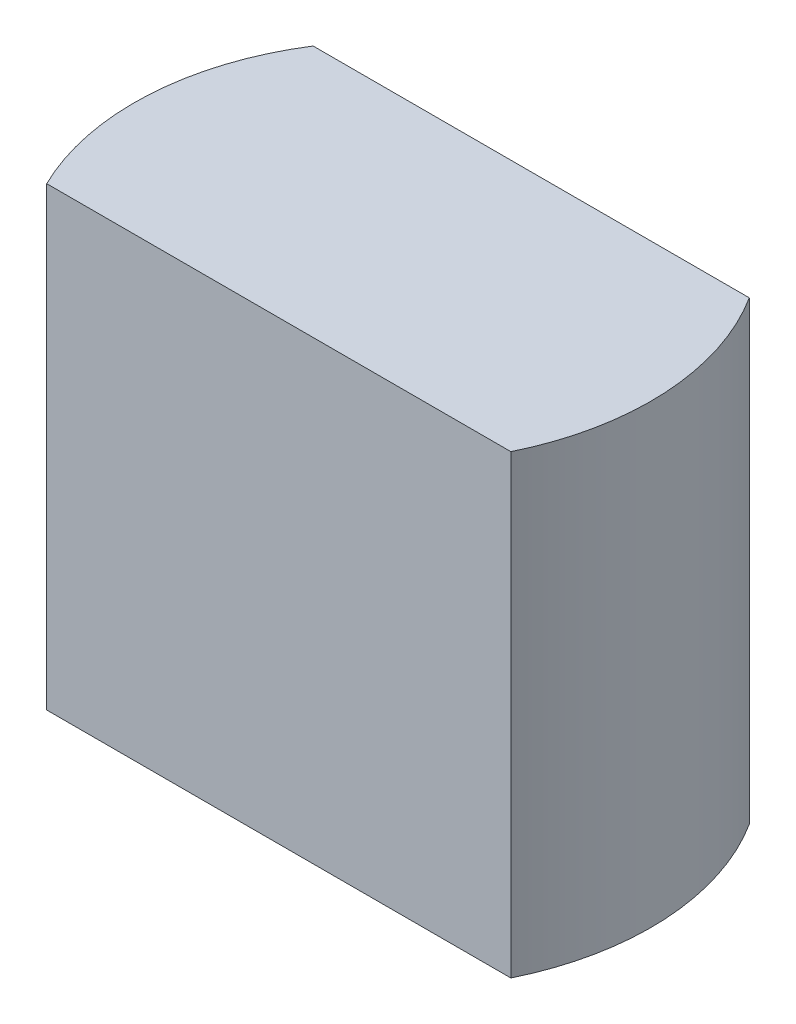
ISO-10303-21;
HEADER;
FILE_DESCRIPTION(('STEP AP214'),'2;1');
FILE_NAME('part.step','',(''),(''),'','','');
FILE_SCHEMA(('AUTOMOTIVE_DESIGN { 1 0 10303 214 1 1 1 1 }'));
ENDSEC;
DATA;
#1=APPLICATION_CONTEXT('core data for automotive mechanical design processes');
#2=APPLICATION_PROTOCOL_DEFINITION('international standard','automotive_design',2000,#1);
#3=PRODUCT_CONTEXT('',#1,'mechanical');
#4=PRODUCT('Part','Part','',(#3));
#5=PRODUCT_RELATED_PRODUCT_CATEGORY('part','',(#4));
#6=PRODUCT_DEFINITION_FORMATION('','',#4);
#7=PRODUCT_DEFINITION_CONTEXT('part definition',#1,'design');
#8=PRODUCT_DEFINITION('design','',#6,#7);
#9=PRODUCT_DEFINITION_SHAPE('','',#8);
#10=(LENGTH_UNIT() NAMED_UNIT(*) SI_UNIT(.MILLI.,.METRE.));
#11=(NAMED_UNIT(*) PLANE_ANGLE_UNIT() SI_UNIT($,.RADIAN.));
#12=(NAMED_UNIT(*) SI_UNIT($,.STERADIAN.) SOLID_ANGLE_UNIT());
#13=UNCERTAINTY_MEASURE_WITH_UNIT(LENGTH_MEASURE(1.E-05),#10,'distance_accuracy_value','');
#14=(GEOMETRIC_REPRESENTATION_CONTEXT(3) GLOBAL_UNCERTAINTY_ASSIGNED_CONTEXT((#13)) GLOBAL_UNIT_ASSIGNED_CONTEXT((#10,
#11,#12)) REPRESENTATION_CONTEXT('',''));
#15=CARTESIAN_POINT('',(0.,0.,0.));
#16=DIRECTION('',(0.,0.,1.));
#17=DIRECTION('',(1.,0.,0.));
#18=AXIS2_PLACEMENT_3D('',#15,#16,#17);
#19=CARTESIAN_POINT('',(0.,7.9371,0.));
#20=DIRECTION('',(0.,-1.,0.));
#21=DIRECTION('',(0.,0.,-1.));
#22=AXIS2_PLACEMENT_3D('',#19,#20,#21);
#23=CYLINDRICAL_SURFACE('',#22,4.5);
#24=CARTESIAN_POINT('',(0.,7.9371,0.));
#25=DIRECTION('',(0.,1.,0.));
#26=DIRECTION('',(0.,0.,1.));
#27=AXIS2_PLACEMENT_3D('',#24,#25,#26);
#28=CIRCLE('',#27,4.5);
#29=CARTESIAN_POINT('',(4.04079297537839,7.9371,1.98040201225223));
#30=VERTEX_POINT('',#29);
#31=CARTESIAN_POINT('',(3.79709635436919,7.9371,-2.41496568829378));
#32=VERTEX_POINT('',#31);
#33=EDGE_CURVE('E79',#30,#32,#28,.T.);
#34=ORIENTED_EDGE('',*,*,#33,.F.);
#35=DIRECTION('',(0.,-1.,0.));
#36=VECTOR('',#35,1.);
#37=CARTESIAN_POINT('',(4.04079297537839,7.9371,1.98040201225223));
#38=LINE('',#37,#36);
#39=CARTESIAN_POINT('',(4.04079297537839,0.,1.98040201225223));
#40=VERTEX_POINT('',#39);
#41=EDGE_CURVE('E73',#30,#40,#38,.T.);
#42=ORIENTED_EDGE('',*,*,#41,.T.);
#43=CARTESIAN_POINT('',(0.,0.,0.));
#44=DIRECTION('',(0.,1.,0.));
#45=DIRECTION('',(0.,0.,1.));
#46=AXIS2_PLACEMENT_3D('',#43,#44,#45);
#47=CIRCLE('',#46,4.5);
#48=CARTESIAN_POINT('',(3.79709635436919,0.,-2.41496568829378));
#49=VERTEX_POINT('',#48);
#50=EDGE_CURVE('E55',#40,#49,#47,.T.);
#51=ORIENTED_EDGE('',*,*,#50,.T.);
#52=DIRECTION('',(0.,-1.,0.));
#53=VECTOR('',#52,1.);
#54=CARTESIAN_POINT('',(3.79709635436919,7.9371,-2.41496568829378));
#55=LINE('',#54,#53);
#56=EDGE_CURVE('E88',#49,#32,#55,.F.);
#57=ORIENTED_EDGE('',*,*,#56,.T.);
#58=EDGE_LOOP('',(#34,#42,#51,#57));
#59=FACE_BOUND('',#58,.T.);
#60=ADVANCED_FACE('F33',(#59),#23,.T.);
#61=CARTESIAN_POINT('',(-3.79709635436919,0.,-2.41496568829378));
#62=VERTEX_POINT('',#61);
#63=CARTESIAN_POINT('',(-4.04079297537839,0.,1.98040201225223));
#64=VERTEX_POINT('',#63);
#65=EDGE_CURVE('E84',#62,#64,#47,.T.);
#66=ORIENTED_EDGE('',*,*,#65,.T.);
#67=DIRECTION('',(0.,-1.,0.));
#68=VECTOR('',#67,1.);
#69=CARTESIAN_POINT('',(-4.04079297537839,7.9371,1.98040201225223));
#70=LINE('',#69,#68);
#71=CARTESIAN_POINT('',(-4.04079297537839,7.9371,1.98040201225223));
#72=VERTEX_POINT('',#71);
#73=EDGE_CURVE('E48',#64,#72,#70,.F.);
#74=ORIENTED_EDGE('',*,*,#73,.T.);
#75=CARTESIAN_POINT('',(-3.79709635436919,7.9371,-2.41496568829378));
#76=VERTEX_POINT('',#75);
#77=EDGE_CURVE('E91',#76,#72,#28,.T.);
#78=ORIENTED_EDGE('',*,*,#77,.F.);
#79=DIRECTION('',(0.,-1.,0.));
#80=VECTOR('',#79,1.);
#81=CARTESIAN_POINT('',(-3.79709635436919,7.9371,-2.41496568829378));
#82=LINE('',#81,#80);
#83=EDGE_CURVE('E85',#76,#62,#82,.T.);
#84=ORIENTED_EDGE('',*,*,#83,.T.);
#85=EDGE_LOOP('',(#66,#74,#78,#84));
#86=FACE_BOUND('',#85,.T.);
#87=ADVANCED_FACE('F35',(#86),#23,.T.);
#88=CARTESIAN_POINT('',(0.,7.9371,0.));
#89=DIRECTION('',(0.,1.,0.));
#90=DIRECTION('',(0.,0.,1.));
#91=AXIS2_PLACEMENT_3D('',#88,#89,#90);
#92=PLANE('',#91);
#93=DIRECTION('',(-1.,0.,0.));
#94=VECTOR('',#93,1.);
#95=CARTESIAN_POINT('',(-4.54189183267463,7.9371,1.98040201225223));
#96=LINE('',#95,#94);
#97=EDGE_CURVE('E98',#30,#72,#96,.T.);
#98=ORIENTED_EDGE('',*,*,#97,.F.);
#99=ORIENTED_EDGE('',*,*,#33,.T.);
#100=DIRECTION('',(1.,0.,0.));
#101=VECTOR('',#100,1.);
#102=CARTESIAN_POINT('',(-4.6630792017599,7.9371,-2.41496568829378));
#103=LINE('',#102,#101);
#104=EDGE_CURVE('E80',#76,#32,#103,.T.);
#105=ORIENTED_EDGE('',*,*,#104,.F.);
#106=ORIENTED_EDGE('',*,*,#77,.T.);
#107=EDGE_LOOP('',(#98,#99,#105,#106));
#108=FACE_BOUND('',#107,.T.);
#109=ADVANCED_FACE('F97',(#108),#92,.T.);
#110=CARTESIAN_POINT('',(0.,0.,0.));
#111=DIRECTION('',(0.,1.,0.));
#112=DIRECTION('',(0.,0.,1.));
#113=AXIS2_PLACEMENT_3D('',#110,#111,#112);
#114=PLANE('',#113);
#115=ORIENTED_EDGE('',*,*,#50,.F.);
#116=DIRECTION('',(-1.,0.,0.));
#117=VECTOR('',#116,1.);
#118=CARTESIAN_POINT('',(0.,0.,1.98040201225223));
#119=LINE('',#118,#117);
#120=EDGE_CURVE('E11',#40,#64,#119,.T.);
#121=ORIENTED_EDGE('',*,*,#120,.T.);
#122=ORIENTED_EDGE('',*,*,#65,.F.);
#123=DIRECTION('',(1.,0.,0.));
#124=VECTOR('',#123,1.);
#125=CARTESIAN_POINT('',(0.,0.,-2.41496568829378));
#126=LINE('',#125,#124);
#127=EDGE_CURVE('E41',#62,#49,#126,.T.);
#128=ORIENTED_EDGE('',*,*,#127,.T.);
#129=EDGE_LOOP('',(#115,#121,#122,#128));
#130=FACE_BOUND('',#129,.T.);
#131=ADVANCED_FACE('F83',(#130),#114,.F.);
#132=CARTESIAN_POINT('',(-4.6630792017599,-10.5310776256555,-2.41496568829378));
#133=DIRECTION('',(0.,0.,1.));
#134=DIRECTION('',(1.,0.,0.));
#135=AXIS2_PLACEMENT_3D('',#132,#133,#134);
#136=PLANE('',#135);
#137=ORIENTED_EDGE('',*,*,#104,.T.);
#138=ORIENTED_EDGE('',*,*,#56,.F.);
#139=ORIENTED_EDGE('',*,*,#127,.F.);
#140=ORIENTED_EDGE('',*,*,#83,.F.);
#141=EDGE_LOOP('',(#137,#138,#139,#140));
#142=FACE_BOUND('',#141,.T.);
#143=ADVANCED_FACE('F100',(#142),#136,.F.);
#144=CARTESIAN_POINT('',(-4.54189183267463,-10.2421865710142,1.98040201225223));
#145=DIRECTION('',(0.,0.,-1.));
#146=DIRECTION('',(-1.,0.,0.));
#147=AXIS2_PLACEMENT_3D('',#144,#145,#146);
#148=PLANE('',#147);
#149=ORIENTED_EDGE('',*,*,#97,.T.);
#150=ORIENTED_EDGE('',*,*,#73,.F.);
#151=ORIENTED_EDGE('',*,*,#120,.F.);
#152=ORIENTED_EDGE('',*,*,#41,.F.);
#153=EDGE_LOOP('',(#149,#150,#151,#152));
#154=FACE_BOUND('',#153,.T.);
#155=ADVANCED_FACE('F72',(#154),#148,.F.);
#156=CLOSED_SHELL('',(#60,#87,#109,#131,#143,#155));
#157=MANIFOLD_SOLID_BREP('B2',#156);
#158=ADVANCED_BREP_SHAPE_REPRESENTATION('',(#18,#157),#14);
#159=SHAPE_DEFINITION_REPRESENTATION(#9,#158);
ENDSEC;
END-ISO-10303-21;
